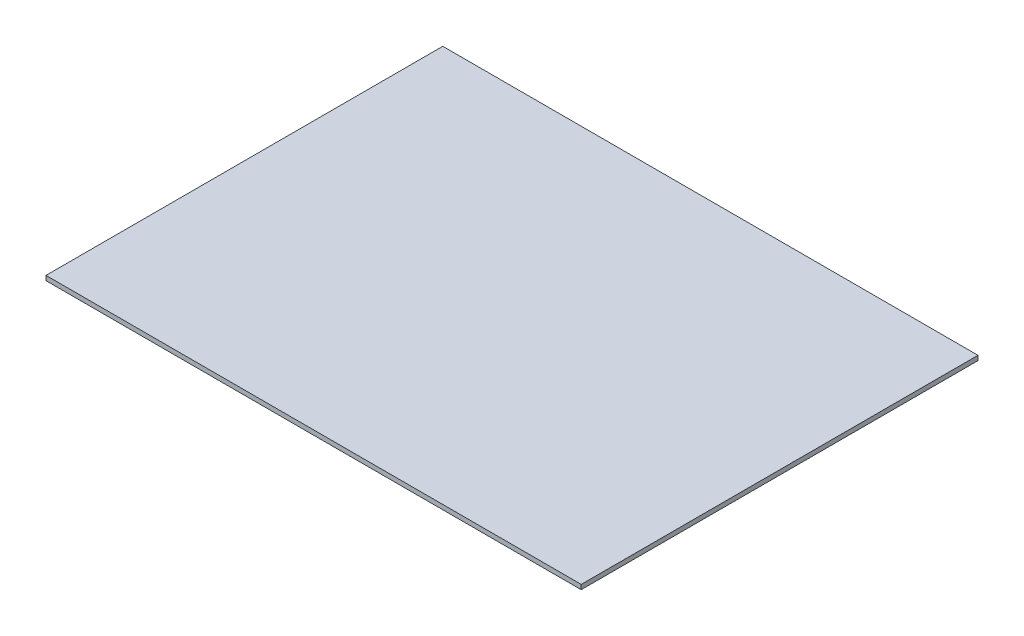
ISO-10303-21;
HEADER;
FILE_DESCRIPTION(('STEP AP214'),'2;1');
FILE_NAME('part.step','',(''),(''),'','','');
FILE_SCHEMA(('AUTOMOTIVE_DESIGN { 1 0 10303 214 1 1 1 1 }'));
ENDSEC;
DATA;
#1=APPLICATION_CONTEXT('core data for automotive mechanical design processes');
#2=APPLICATION_PROTOCOL_DEFINITION('international standard','automotive_design',2000,#1);
#3=PRODUCT_CONTEXT('',#1,'mechanical');
#4=PRODUCT('Part','Part','',(#3));
#5=PRODUCT_RELATED_PRODUCT_CATEGORY('part','',(#4));
#6=PRODUCT_DEFINITION_FORMATION('','',#4);
#7=PRODUCT_DEFINITION_CONTEXT('part definition',#1,'design');
#8=PRODUCT_DEFINITION('design','',#6,#7);
#9=PRODUCT_DEFINITION_SHAPE('','',#8);
#10=(LENGTH_UNIT() NAMED_UNIT(*) SI_UNIT(.MILLI.,.METRE.));
#11=(NAMED_UNIT(*) PLANE_ANGLE_UNIT() SI_UNIT($,.RADIAN.));
#12=(NAMED_UNIT(*) SI_UNIT($,.STERADIAN.) SOLID_ANGLE_UNIT());
#13=UNCERTAINTY_MEASURE_WITH_UNIT(LENGTH_MEASURE(1.E-05),#10,'distance_accuracy_value','');
#14=(GEOMETRIC_REPRESENTATION_CONTEXT(3) GLOBAL_UNCERTAINTY_ASSIGNED_CONTEXT((#13)) GLOBAL_UNIT_ASSIGNED_CONTEXT((#10,
#11,#12)) REPRESENTATION_CONTEXT('',''));
#15=CARTESIAN_POINT('',(0.,0.,0.));
#16=DIRECTION('',(0.,0.,1.));
#17=DIRECTION('',(1.,0.,0.));
#18=AXIS2_PLACEMENT_3D('',#15,#16,#17);
#19=CARTESIAN_POINT('',(0.,3.,0.));
#20=DIRECTION('',(1.,0.,0.));
#21=DIRECTION('',(0.,0.,-1.));
#22=AXIS2_PLACEMENT_3D('',#19,#20,#21);
#23=PLANE('',#22);
#24=DIRECTION('',(0.,0.,1.));
#25=VECTOR('',#24,1.);
#26=CARTESIAN_POINT('',(0.,0.,0.));
#27=LINE('',#26,#25);
#28=CARTESIAN_POINT('',(0.,0.,-258.));
#29=VERTEX_POINT('',#28);
#30=CARTESIAN_POINT('',(0.,0.,0.));
#31=VERTEX_POINT('',#30);
#32=EDGE_CURVE('E98',#29,#31,#27,.T.);
#33=ORIENTED_EDGE('',*,*,#32,.T.);
#34=DIRECTION('',(0.,-1.,0.));
#35=VECTOR('',#34,1.);
#36=CARTESIAN_POINT('',(0.,3.,0.));
#37=LINE('',#36,#35);
#38=CARTESIAN_POINT('',(0.,3.,0.));
#39=VERTEX_POINT('',#38);
#40=EDGE_CURVE('E11',#39,#31,#37,.T.);
#41=ORIENTED_EDGE('',*,*,#40,.F.);
#42=DIRECTION('',(0.,0.,1.));
#43=VECTOR('',#42,1.);
#44=CARTESIAN_POINT('',(0.,3.,0.));
#45=LINE('',#44,#43);
#46=CARTESIAN_POINT('',(0.,3.,-258.));
#47=VERTEX_POINT('',#46);
#48=EDGE_CURVE('E86',#47,#39,#45,.T.);
#49=ORIENTED_EDGE('',*,*,#48,.F.);
#50=DIRECTION('',(0.,-1.,0.));
#51=VECTOR('',#50,1.);
#52=CARTESIAN_POINT('',(0.,3.,-258.));
#53=LINE('',#52,#51);
#54=EDGE_CURVE('E94',#47,#29,#53,.T.);
#55=ORIENTED_EDGE('',*,*,#54,.T.);
#56=EDGE_LOOP('',(#33,#41,#49,#55));
#57=FACE_BOUND('',#56,.T.);
#58=ADVANCED_FACE('F35',(#57),#23,.F.);
#59=CARTESIAN_POINT('',(0.,3.,0.));
#60=DIRECTION('',(0.,0.,-1.));
#61=DIRECTION('',(-1.,0.,0.));
#62=AXIS2_PLACEMENT_3D('',#59,#60,#61);
#63=PLANE('',#62);
#64=DIRECTION('',(1.,0.,0.));
#65=VECTOR('',#64,1.);
#66=CARTESIAN_POINT('',(0.,0.,0.));
#67=LINE('',#66,#65);
#68=CARTESIAN_POINT('',(348.,0.,0.));
#69=VERTEX_POINT('',#68);
#70=EDGE_CURVE('E90',#31,#69,#67,.T.);
#71=ORIENTED_EDGE('',*,*,#70,.T.);
#72=DIRECTION('',(0.,-1.,0.));
#73=VECTOR('',#72,1.);
#74=CARTESIAN_POINT('',(348.,3.,0.));
#75=LINE('',#74,#73);
#76=CARTESIAN_POINT('',(348.,3.,0.));
#77=VERTEX_POINT('',#76);
#78=EDGE_CURVE('E43',#77,#69,#75,.T.);
#79=ORIENTED_EDGE('',*,*,#78,.F.);
#80=DIRECTION('',(1.,0.,0.));
#81=VECTOR('',#80,1.);
#82=CARTESIAN_POINT('',(0.,3.,0.));
#83=LINE('',#82,#81);
#84=EDGE_CURVE('E81',#39,#77,#83,.T.);
#85=ORIENTED_EDGE('',*,*,#84,.F.);
#86=ORIENTED_EDGE('',*,*,#40,.T.);
#87=EDGE_LOOP('',(#71,#79,#85,#86));
#88=FACE_BOUND('',#87,.T.);
#89=ADVANCED_FACE('F89',(#88),#63,.F.);
#90=CARTESIAN_POINT('',(348.,3.,0.));
#91=DIRECTION('',(-1.,0.,0.));
#92=DIRECTION('',(0.,0.,1.));
#93=AXIS2_PLACEMENT_3D('',#90,#91,#92);
#94=PLANE('',#93);
#95=DIRECTION('',(0.,0.,-1.));
#96=VECTOR('',#95,1.);
#97=CARTESIAN_POINT('',(348.,0.,0.));
#98=LINE('',#97,#96);
#99=CARTESIAN_POINT('',(348.,0.,-258.));
#100=VERTEX_POINT('',#99);
#101=EDGE_CURVE('E68',#69,#100,#98,.T.);
#102=ORIENTED_EDGE('',*,*,#101,.T.);
#103=DIRECTION('',(0.,-1.,0.));
#104=VECTOR('',#103,1.);
#105=CARTESIAN_POINT('',(348.,3.,-258.));
#106=LINE('',#105,#104);
#107=CARTESIAN_POINT('',(348.,3.,-258.));
#108=VERTEX_POINT('',#107);
#109=EDGE_CURVE('E91',#108,#100,#106,.T.);
#110=ORIENTED_EDGE('',*,*,#109,.F.);
#111=DIRECTION('',(0.,0.,-1.));
#112=VECTOR('',#111,1.);
#113=CARTESIAN_POINT('',(348.,3.,0.));
#114=LINE('',#113,#112);
#115=EDGE_CURVE('E84',#77,#108,#114,.T.);
#116=ORIENTED_EDGE('',*,*,#115,.F.);
#117=ORIENTED_EDGE('',*,*,#78,.T.);
#118=EDGE_LOOP('',(#102,#110,#116,#117));
#119=FACE_BOUND('',#118,.T.);
#120=ADVANCED_FACE('F92',(#119),#94,.F.);
#121=CARTESIAN_POINT('',(0.,3.,-258.));
#122=DIRECTION('',(0.,0.,1.));
#123=DIRECTION('',(1.,0.,0.));
#124=AXIS2_PLACEMENT_3D('',#121,#122,#123);
#125=PLANE('',#124);
#126=DIRECTION('',(-1.,0.,0.));
#127=VECTOR('',#126,1.);
#128=CARTESIAN_POINT('',(0.,0.,-258.));
#129=LINE('',#128,#127);
#130=EDGE_CURVE('E74',#100,#29,#129,.T.);
#131=ORIENTED_EDGE('',*,*,#130,.T.);
#132=ORIENTED_EDGE('',*,*,#54,.F.);
#133=DIRECTION('',(-1.,0.,0.));
#134=VECTOR('',#133,1.);
#135=CARTESIAN_POINT('',(0.,3.,-258.));
#136=LINE('',#135,#134);
#137=EDGE_CURVE('E51',#108,#47,#136,.T.);
#138=ORIENTED_EDGE('',*,*,#137,.F.);
#139=ORIENTED_EDGE('',*,*,#109,.T.);
#140=EDGE_LOOP('',(#131,#132,#138,#139));
#141=FACE_BOUND('',#140,.T.);
#142=ADVANCED_FACE('F105',(#141),#125,.F.);
#143=CARTESIAN_POINT('',(0.,3.,0.));
#144=DIRECTION('',(0.,-1.,0.));
#145=DIRECTION('',(0.,0.,-1.));
#146=AXIS2_PLACEMENT_3D('',#143,#144,#145);
#147=PLANE('',#146);
#148=ORIENTED_EDGE('',*,*,#48,.T.);
#149=ORIENTED_EDGE('',*,*,#84,.T.);
#150=ORIENTED_EDGE('',*,*,#115,.T.);
#151=ORIENTED_EDGE('',*,*,#137,.T.);
#152=EDGE_LOOP('',(#148,#149,#150,#151));
#153=FACE_BOUND('',#152,.T.);
#154=ADVANCED_FACE('F82',(#153),#147,.F.);
#155=CARTESIAN_POINT('',(0.,0.,0.));
#156=DIRECTION('',(0.,-1.,0.));
#157=DIRECTION('',(0.,0.,-1.));
#158=AXIS2_PLACEMENT_3D('',#155,#156,#157);
#159=PLANE('',#158);
#160=ORIENTED_EDGE('',*,*,#32,.F.);
#161=ORIENTED_EDGE('',*,*,#130,.F.);
#162=ORIENTED_EDGE('',*,*,#101,.F.);
#163=ORIENTED_EDGE('',*,*,#70,.F.);
#164=EDGE_LOOP('',(#160,#161,#162,#163));
#165=FACE_BOUND('',#164,.T.);
#166=ADVANCED_FACE('F108',(#165),#159,.T.);
#167=CLOSED_SHELL('',(#58,#89,#120,#142,#154,#166));
#168=MANIFOLD_SOLID_BREP('B2',#167);
#169=ADVANCED_BREP_SHAPE_REPRESENTATION('',(#18,#168),#14);
#170=SHAPE_DEFINITION_REPRESENTATION(#9,#169);
ENDSEC;
END-ISO-10303-21;
